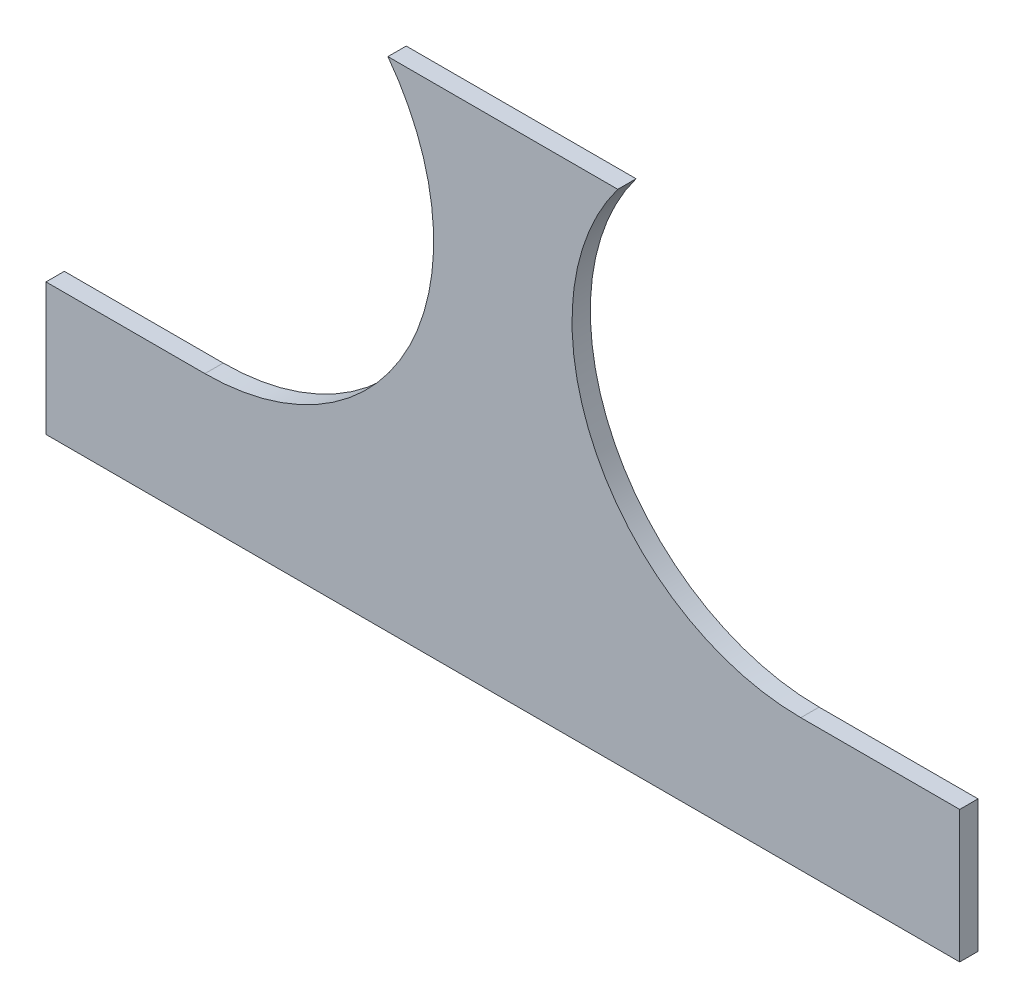
ISO-10303-21;
HEADER;
FILE_DESCRIPTION(('STEP AP214'),'2;1');
FILE_NAME('part.step','',(''),(''),'','','');
FILE_SCHEMA(('AUTOMOTIVE_DESIGN { 1 0 10303 214 1 1 1 1 }'));
ENDSEC;
DATA;
#1=APPLICATION_CONTEXT('core data for automotive mechanical design processes');
#2=APPLICATION_PROTOCOL_DEFINITION('international standard','automotive_design',2000,#1);
#3=PRODUCT_CONTEXT('',#1,'mechanical');
#4=PRODUCT('Part','Part','',(#3));
#5=PRODUCT_RELATED_PRODUCT_CATEGORY('part','',(#4));
#6=PRODUCT_DEFINITION_FORMATION('','',#4);
#7=PRODUCT_DEFINITION_CONTEXT('part definition',#1,'design');
#8=PRODUCT_DEFINITION('design','',#6,#7);
#9=PRODUCT_DEFINITION_SHAPE('','',#8);
#10=(LENGTH_UNIT() NAMED_UNIT(*) SI_UNIT(.MILLI.,.METRE.));
#11=(NAMED_UNIT(*) PLANE_ANGLE_UNIT() SI_UNIT($,.RADIAN.));
#12=(NAMED_UNIT(*) SI_UNIT($,.STERADIAN.) SOLID_ANGLE_UNIT());
#13=UNCERTAINTY_MEASURE_WITH_UNIT(LENGTH_MEASURE(1.E-05),#10,'distance_accuracy_value','');
#14=(GEOMETRIC_REPRESENTATION_CONTEXT(3) GLOBAL_UNCERTAINTY_ASSIGNED_CONTEXT((#13)) GLOBAL_UNIT_ASSIGNED_CONTEXT((#10,
#11,#12)) REPRESENTATION_CONTEXT('',''));
#15=CARTESIAN_POINT('',(0.,0.,0.));
#16=DIRECTION('',(0.,0.,1.));
#17=DIRECTION('',(1.,0.,0.));
#18=AXIS2_PLACEMENT_3D('',#15,#16,#17);
#19=CARTESIAN_POINT('',(0.,0.,5.));
#20=DIRECTION('',(1.,0.,0.));
#21=DIRECTION('',(0.,1.,0.));
#22=AXIS2_PLACEMENT_3D('',#19,#20,#21);
#23=PLANE('',#22);
#24=DIRECTION('',(0.,-1.,0.));
#25=VECTOR('',#24,1.);
#26=CARTESIAN_POINT('',(0.,0.,0.));
#27=LINE('',#26,#25);
#28=CARTESIAN_POINT('',(0.,-100.,0.));
#29=VERTEX_POINT('',#28);
#30=CARTESIAN_POINT('',(0.,-136.09541139609,0.));
#31=VERTEX_POINT('',#30);
#32=EDGE_CURVE('E125',#29,#31,#27,.T.);
#33=ORIENTED_EDGE('',*,*,#32,.T.);
#34=DIRECTION('',(0.,0.,1.));
#35=VECTOR('',#34,1.);
#36=CARTESIAN_POINT('',(0.,-136.09541139609,0.));
#37=LINE('',#36,#35);
#38=CARTESIAN_POINT('',(0.,-136.09541139609,5.));
#39=VERTEX_POINT('',#38);
#40=EDGE_CURVE('E152',#31,#39,#37,.T.);
#41=ORIENTED_EDGE('',*,*,#40,.T.);
#42=DIRECTION('',(0.,-1.,0.));
#43=VECTOR('',#42,1.);
#44=CARTESIAN_POINT('',(0.,0.,5.));
#45=LINE('',#44,#43);
#46=CARTESIAN_POINT('',(0.,-100.,5.));
#47=VERTEX_POINT('',#46);
#48=EDGE_CURVE('E120',#47,#39,#45,.T.);
#49=ORIENTED_EDGE('',*,*,#48,.F.);
#50=DIRECTION('',(0.,0.,1.));
#51=VECTOR('',#50,1.);
#52=CARTESIAN_POINT('',(0.,-100.,0.));
#53=LINE('',#52,#51);
#54=EDGE_CURVE('E139',#29,#47,#53,.T.);
#55=ORIENTED_EDGE('',*,*,#54,.F.);
#56=EDGE_LOOP('',(#33,#41,#49,#55));
#57=FACE_BOUND('',#56,.T.);
#58=ADVANCED_FACE('F35',(#57),#23,.F.);
#59=CARTESIAN_POINT('',(249.6,0.,5.));
#60=DIRECTION('',(-1.,0.,0.));
#61=DIRECTION('',(0.,-1.,0.));
#62=AXIS2_PLACEMENT_3D('',#59,#60,#61);
#63=PLANE('',#62);
#64=DIRECTION('',(0.,1.,0.));
#65=VECTOR('',#64,1.);
#66=CARTESIAN_POINT('',(249.6,0.,5.));
#67=LINE('',#66,#65);
#68=CARTESIAN_POINT('',(249.6,-136.09541139609,5.));
#69=VERTEX_POINT('',#68);
#70=CARTESIAN_POINT('',(249.6,-100.,5.));
#71=VERTEX_POINT('',#70);
#72=EDGE_CURVE('E123',#69,#71,#67,.T.);
#73=ORIENTED_EDGE('',*,*,#72,.F.);
#74=DIRECTION('',(0.,0.,1.));
#75=VECTOR('',#74,1.);
#76=CARTESIAN_POINT('',(249.6,-136.09541139609,0.));
#77=LINE('',#76,#75);
#78=CARTESIAN_POINT('',(249.6,-136.09541139609,0.));
#79=VERTEX_POINT('',#78);
#80=EDGE_CURVE('E150',#79,#69,#77,.T.);
#81=ORIENTED_EDGE('',*,*,#80,.F.);
#82=DIRECTION('',(0.,1.,0.));
#83=VECTOR('',#82,1.);
#84=CARTESIAN_POINT('',(249.6,0.,0.));
#85=LINE('',#84,#83);
#86=CARTESIAN_POINT('',(249.6,-100.,0.));
#87=VERTEX_POINT('',#86);
#88=EDGE_CURVE('E121',#79,#87,#85,.T.);
#89=ORIENTED_EDGE('',*,*,#88,.T.);
#90=DIRECTION('',(0.,0.,1.));
#91=VECTOR('',#90,1.);
#92=CARTESIAN_POINT('',(249.6,-100.,0.));
#93=LINE('',#92,#91);
#94=EDGE_CURVE('E57',#87,#71,#93,.T.);
#95=ORIENTED_EDGE('',*,*,#94,.T.);
#96=EDGE_LOOP('',(#73,#81,#89,#95));
#97=FACE_BOUND('',#96,.T.);
#98=ADVANCED_FACE('F165',(#97),#63,.F.);
#99=CARTESIAN_POINT('',(0.,0.,5.));
#100=DIRECTION('',(0.,-1.,0.));
#101=DIRECTION('',(1.,0.,0.));
#102=AXIS2_PLACEMENT_3D('',#99,#100,#101);
#103=PLANE('',#102);
#104=DIRECTION('',(-1.,0.,0.));
#105=VECTOR('',#104,1.);
#106=CARTESIAN_POINT('',(0.,0.,5.));
#107=LINE('',#106,#105);
#108=CARTESIAN_POINT('',(156.197139998897,0.,5.));
#109=VERTEX_POINT('',#108);
#110=CARTESIAN_POINT('',(93.4028600011032,0.,5.));
#111=VERTEX_POINT('',#110);
#112=EDGE_CURVE('E42',#109,#111,#107,.T.);
#113=ORIENTED_EDGE('',*,*,#112,.F.);
#114=DIRECTION('',(0.,0.,1.));
#115=VECTOR('',#114,1.);
#116=CARTESIAN_POINT('',(156.197139998897,0.,0.));
#117=LINE('',#116,#115);
#118=CARTESIAN_POINT('',(156.197139998897,0.,0.));
#119=VERTEX_POINT('',#118);
#120=EDGE_CURVE('E130',#109,#119,#117,.F.);
#121=ORIENTED_EDGE('',*,*,#120,.T.);
#122=DIRECTION('',(-1.,0.,0.));
#123=VECTOR('',#122,1.);
#124=CARTESIAN_POINT('',(0.,0.,0.));
#125=LINE('',#124,#123);
#126=CARTESIAN_POINT('',(93.4028600011032,0.,0.));
#127=VERTEX_POINT('',#126);
#128=EDGE_CURVE('E116',#119,#127,#125,.T.);
#129=ORIENTED_EDGE('',*,*,#128,.T.);
#130=DIRECTION('',(0.,0.,1.));
#131=VECTOR('',#130,1.);
#132=CARTESIAN_POINT('',(93.4028600011032,0.,0.));
#133=LINE('',#132,#131);
#134=EDGE_CURVE('E136',#127,#111,#133,.T.);
#135=ORIENTED_EDGE('',*,*,#134,.T.);
#136=EDGE_LOOP('',(#113,#121,#129,#135));
#137=FACE_BOUND('',#136,.T.);
#138=ADVANCED_FACE('F181',(#137),#103,.F.);
#139=CARTESIAN_POINT('',(0.,0.,5.));
#140=DIRECTION('',(0.,0.,1.));
#141=DIRECTION('',(1.,0.,0.));
#142=AXIS2_PLACEMENT_3D('',#139,#140,#141);
#143=PLANE('',#142);
#144=DIRECTION('',(-1.,0.,0.));
#145=VECTOR('',#144,1.);
#146=CARTESIAN_POINT('',(0.,-136.09541139609,5.));
#147=LINE('',#146,#145);
#148=EDGE_CURVE('E156',#69,#39,#147,.T.);
#149=ORIENTED_EDGE('',*,*,#148,.F.);
#150=ORIENTED_EDGE('',*,*,#72,.T.);
#151=DIRECTION('',(1.,0.,0.));
#152=VECTOR('',#151,1.);
#153=CARTESIAN_POINT('',(249.6,-100.,5.));
#154=LINE('',#153,#152);
#155=CARTESIAN_POINT('',(206.197139998897,-100.,5.));
#156=VERTEX_POINT('',#155);
#157=EDGE_CURVE('E111',#156,#71,#154,.T.);
#158=ORIENTED_EDGE('',*,*,#157,.F.);
#159=CARTESIAN_POINT('',(206.197139998897,-37.5,5.));
#160=DIRECTION('',(0.,0.,1.));
#161=DIRECTION('',(1.,0.,0.));
#162=AXIS2_PLACEMENT_3D('',#159,#160,#161);
#163=CIRCLE('',#162,62.5);
#164=EDGE_CURVE('E103',#109,#156,#163,.T.);
#165=ORIENTED_EDGE('',*,*,#164,.F.);
#166=ORIENTED_EDGE('',*,*,#112,.T.);
#167=CARTESIAN_POINT('',(43.4028600011032,-37.5,5.));
#168=DIRECTION('',(0.,0.,1.));
#169=DIRECTION('',(-1.,0.,0.));
#170=AXIS2_PLACEMENT_3D('',#167,#168,#169);
#171=CIRCLE('',#170,62.5);
#172=CARTESIAN_POINT('',(43.4028600011032,-100.,5.));
#173=VERTEX_POINT('',#172);
#174=EDGE_CURVE('E142',#173,#111,#171,.T.);
#175=ORIENTED_EDGE('',*,*,#174,.F.);
#176=DIRECTION('',(1.,0.,0.));
#177=VECTOR('',#176,1.);
#178=CARTESIAN_POINT('',(0.,-100.,5.));
#179=LINE('',#178,#177);
#180=EDGE_CURVE('E145',#47,#173,#179,.T.);
#181=ORIENTED_EDGE('',*,*,#180,.F.);
#182=ORIENTED_EDGE('',*,*,#48,.T.);
#183=EDGE_LOOP('',(#149,#150,#158,#165,#166,#175,#181,#182));
#184=FACE_BOUND('',#183,.T.);
#185=ADVANCED_FACE('F168',(#184),#143,.T.);
#186=CARTESIAN_POINT('',(0.,0.,0.));
#187=DIRECTION('',(0.,0.,1.));
#188=DIRECTION('',(1.,0.,0.));
#189=AXIS2_PLACEMENT_3D('',#186,#187,#188);
#190=PLANE('',#189);
#191=ORIENTED_EDGE('',*,*,#88,.F.);
#192=DIRECTION('',(-1.,0.,0.));
#193=VECTOR('',#192,1.);
#194=CARTESIAN_POINT('',(0.,-136.09541139609,0.));
#195=LINE('',#194,#193);
#196=EDGE_CURVE('E153',#79,#31,#195,.T.);
#197=ORIENTED_EDGE('',*,*,#196,.T.);
#198=ORIENTED_EDGE('',*,*,#32,.F.);
#199=DIRECTION('',(1.,0.,0.));
#200=VECTOR('',#199,1.);
#201=CARTESIAN_POINT('',(0.,-100.,0.));
#202=LINE('',#201,#200);
#203=CARTESIAN_POINT('',(43.4028600011032,-100.,0.));
#204=VERTEX_POINT('',#203);
#205=EDGE_CURVE('E144',#29,#204,#202,.T.);
#206=ORIENTED_EDGE('',*,*,#205,.T.);
#207=CARTESIAN_POINT('',(43.4028600011032,-37.5,0.));
#208=DIRECTION('',(0.,0.,1.));
#209=DIRECTION('',(-1.,0.,0.));
#210=AXIS2_PLACEMENT_3D('',#207,#208,#209);
#211=CIRCLE('',#210,62.5);
#212=EDGE_CURVE('E49',#204,#127,#211,.T.);
#213=ORIENTED_EDGE('',*,*,#212,.T.);
#214=ORIENTED_EDGE('',*,*,#128,.F.);
#215=CARTESIAN_POINT('',(206.197139998897,-37.5,0.));
#216=DIRECTION('',(0.,0.,1.));
#217=DIRECTION('',(1.,0.,0.));
#218=AXIS2_PLACEMENT_3D('',#215,#216,#217);
#219=CIRCLE('',#218,62.5);
#220=CARTESIAN_POINT('',(206.197139998897,-100.,0.));
#221=VERTEX_POINT('',#220);
#222=EDGE_CURVE('E11',#119,#221,#219,.T.);
#223=ORIENTED_EDGE('',*,*,#222,.T.);
#224=DIRECTION('',(1.,0.,0.));
#225=VECTOR('',#224,1.);
#226=CARTESIAN_POINT('',(249.6,-100.,0.));
#227=LINE('',#226,#225);
#228=EDGE_CURVE('E105',#221,#87,#227,.T.);
#229=ORIENTED_EDGE('',*,*,#228,.T.);
#230=EDGE_LOOP('',(#191,#197,#198,#206,#213,#214,#223,#229));
#231=FACE_BOUND('',#230,.T.);
#232=ADVANCED_FACE('F114',(#231),#190,.F.);
#233=CARTESIAN_POINT('',(43.4028600011032,-37.5,0.));
#234=DIRECTION('',(0.,0.,1.));
#235=DIRECTION('',(1.,0.,0.));
#236=AXIS2_PLACEMENT_3D('',#233,#234,#235);
#237=CYLINDRICAL_SURFACE('',#236,62.5);
#238=ORIENTED_EDGE('',*,*,#212,.F.);
#239=DIRECTION('',(0.,0.,1.));
#240=VECTOR('',#239,1.);
#241=CARTESIAN_POINT('',(43.4028600011032,-100.,0.));
#242=LINE('',#241,#240);
#243=EDGE_CURVE('E138',#204,#173,#242,.T.);
#244=ORIENTED_EDGE('',*,*,#243,.T.);
#245=ORIENTED_EDGE('',*,*,#174,.T.);
#246=ORIENTED_EDGE('',*,*,#134,.F.);
#247=EDGE_LOOP('',(#238,#244,#245,#246));
#248=FACE_BOUND('',#247,.T.);
#249=ADVANCED_FACE('F179',(#248),#237,.F.);
#250=CARTESIAN_POINT('',(0.,-100.,0.));
#251=DIRECTION('',(0.,-1.,0.));
#252=DIRECTION('',(1.,0.,0.));
#253=AXIS2_PLACEMENT_3D('',#250,#251,#252);
#254=PLANE('',#253);
#255=ORIENTED_EDGE('',*,*,#180,.T.);
#256=ORIENTED_EDGE('',*,*,#243,.F.);
#257=ORIENTED_EDGE('',*,*,#205,.F.);
#258=ORIENTED_EDGE('',*,*,#54,.T.);
#259=EDGE_LOOP('',(#255,#256,#257,#258));
#260=FACE_BOUND('',#259,.T.);
#261=ADVANCED_FACE('F177',(#260),#254,.F.);
#262=CARTESIAN_POINT('',(206.197139998897,-37.5,0.));
#263=DIRECTION('',(0.,0.,1.));
#264=DIRECTION('',(1.,0.,0.));
#265=AXIS2_PLACEMENT_3D('',#262,#263,#264);
#266=CYLINDRICAL_SURFACE('',#265,62.5);
#267=ORIENTED_EDGE('',*,*,#164,.T.);
#268=DIRECTION('',(0.,0.,1.));
#269=VECTOR('',#268,1.);
#270=CARTESIAN_POINT('',(206.197139998897,-100.,0.));
#271=LINE('',#270,#269);
#272=EDGE_CURVE('E99',#221,#156,#271,.T.);
#273=ORIENTED_EDGE('',*,*,#272,.F.);
#274=ORIENTED_EDGE('',*,*,#222,.F.);
#275=ORIENTED_EDGE('',*,*,#120,.F.);
#276=EDGE_LOOP('',(#267,#273,#274,#275));
#277=FACE_BOUND('',#276,.T.);
#278=ADVANCED_FACE('F100',(#277),#266,.F.);
#279=CARTESIAN_POINT('',(249.6,-100.,0.));
#280=DIRECTION('',(0.,-1.,0.));
#281=DIRECTION('',(1.,0.,0.));
#282=AXIS2_PLACEMENT_3D('',#279,#280,#281);
#283=PLANE('',#282);
#284=ORIENTED_EDGE('',*,*,#157,.T.);
#285=ORIENTED_EDGE('',*,*,#94,.F.);
#286=ORIENTED_EDGE('',*,*,#228,.F.);
#287=ORIENTED_EDGE('',*,*,#272,.T.);
#288=EDGE_LOOP('',(#284,#285,#286,#287));
#289=FACE_BOUND('',#288,.T.);
#290=ADVANCED_FACE('F107',(#289),#283,.F.);
#291=CARTESIAN_POINT('',(0.,-136.09541139609,0.));
#292=DIRECTION('',(0.,1.,0.));
#293=DIRECTION('',(0.,0.,1.));
#294=AXIS2_PLACEMENT_3D('',#291,#292,#293);
#295=PLANE('',#294);
#296=ORIENTED_EDGE('',*,*,#148,.T.);
#297=ORIENTED_EDGE('',*,*,#40,.F.);
#298=ORIENTED_EDGE('',*,*,#196,.F.);
#299=ORIENTED_EDGE('',*,*,#80,.T.);
#300=EDGE_LOOP('',(#296,#297,#298,#299));
#301=FACE_BOUND('',#300,.T.);
#302=ADVANCED_FACE('F172',(#301),#295,.F.);
#303=CLOSED_SHELL('',(#58,#98,#138,#185,#232,#249,#261,#278,#290,#302));
#304=MANIFOLD_SOLID_BREP('B2',#303);
#305=ADVANCED_BREP_SHAPE_REPRESENTATION('',(#18,#304),#14);
#306=SHAPE_DEFINITION_REPRESENTATION(#9,#305);
ENDSEC;
END-ISO-10303-21;
